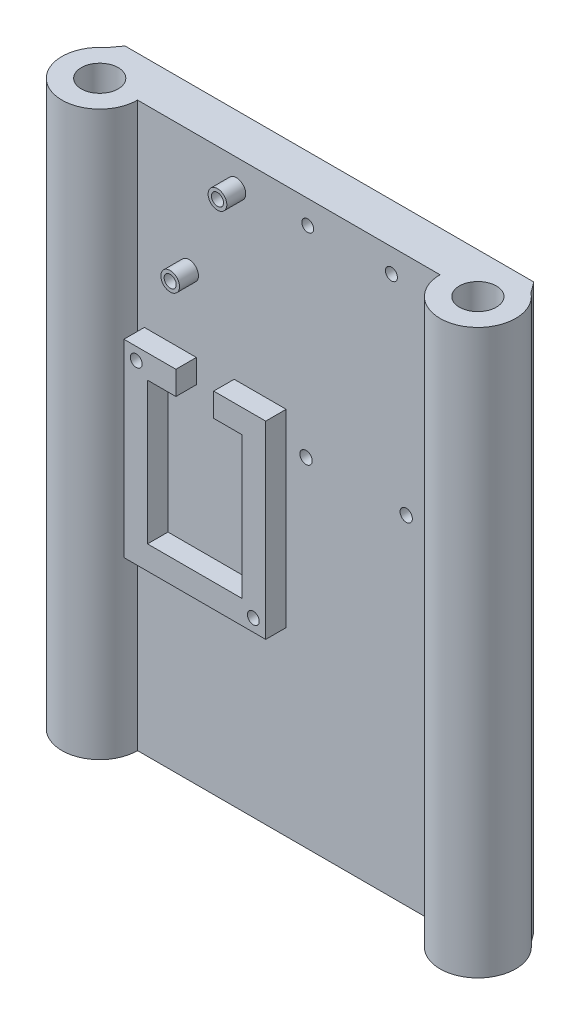
ISO-10303-21;
HEADER;
FILE_DESCRIPTION(('STEP AP214'),'2;1');
FILE_NAME('part.step','',(''),(''),'','','');
FILE_SCHEMA(('AUTOMOTIVE_DESIGN { 1 0 10303 214 1 1 1 1 }'));
ENDSEC;
DATA;
#1=APPLICATION_CONTEXT('core data for automotive mechanical design processes');
#2=APPLICATION_PROTOCOL_DEFINITION('international standard','automotive_design',2000,#1);
#3=PRODUCT_CONTEXT('',#1,'mechanical');
#4=PRODUCT('Part','Part','',(#3));
#5=PRODUCT_RELATED_PRODUCT_CATEGORY('part','',(#4));
#6=PRODUCT_DEFINITION_FORMATION('','',#4);
#7=PRODUCT_DEFINITION_CONTEXT('part definition',#1,'design');
#8=PRODUCT_DEFINITION('design','',#6,#7);
#9=PRODUCT_DEFINITION_SHAPE('','',#8);
#10=(LENGTH_UNIT() NAMED_UNIT(*) SI_UNIT(.MILLI.,.METRE.));
#11=(NAMED_UNIT(*) PLANE_ANGLE_UNIT() SI_UNIT($,.RADIAN.));
#12=(NAMED_UNIT(*) SI_UNIT($,.STERADIAN.) SOLID_ANGLE_UNIT());
#13=UNCERTAINTY_MEASURE_WITH_UNIT(LENGTH_MEASURE(1.E-05),#10,'distance_accuracy_value','');
#14=(GEOMETRIC_REPRESENTATION_CONTEXT(3) GLOBAL_UNCERTAINTY_ASSIGNED_CONTEXT((#13)) GLOBAL_UNIT_ASSIGNED_CONTEXT((#10,
#11,#12)) REPRESENTATION_CONTEXT('',''));
#15=CARTESIAN_POINT('',(0.,0.,0.));
#16=DIRECTION('',(0.,0.,1.));
#17=DIRECTION('',(1.,0.,0.));
#18=AXIS2_PLACEMENT_3D('',#15,#16,#17);
#19=CARTESIAN_POINT('',(0.,75.692,0.));
#20=DIRECTION('',(0.,0.,-1.));
#21=DIRECTION('',(-1.,0.,0.));
#22=AXIS2_PLACEMENT_3D('',#19,#20,#21);
#23=PLANE('',#22);
#24=DIRECTION('',(1.,0.,0.));
#25=VECTOR('',#24,1.);
#26=CARTESIAN_POINT('',(0.,17.3606924279355,0.));
#27=LINE('',#26,#25);
#28=CARTESIAN_POINT('',(-14.6777878533402,17.3606924279355,0.));
#29=VERTEX_POINT('',#28);
#30=CARTESIAN_POINT('',(-7.05778785334015,17.3606924279355,0.));
#31=VERTEX_POINT('',#30);
#32=EDGE_CURVE('E55',#29,#31,#27,.T.);
#33=ORIENTED_EDGE('',*,*,#32,.F.);
#34=DIRECTION('',(0.,1.,0.));
#35=VECTOR('',#34,1.);
#36=CARTESIAN_POINT('',(-14.6777878533402,0.,0.));
#37=LINE('',#36,#35);
#38=CARTESIAN_POINT('',(-14.6777878533402,23.7106924279355,0.));
#39=VERTEX_POINT('',#38);
#40=EDGE_CURVE('E170',#29,#39,#37,.T.);
#41=ORIENTED_EDGE('',*,*,#40,.T.);
#42=DIRECTION('',(-1.,0.,0.));
#43=VECTOR('',#42,1.);
#44=CARTESIAN_POINT('',(0.,23.7106924279355,0.));
#45=LINE('',#44,#43);
#46=CARTESIAN_POINT('',(-0.707787853340156,23.7106924279355,0.));
#47=VERTEX_POINT('',#46);
#48=EDGE_CURVE('E188',#47,#39,#45,.T.);
#49=ORIENTED_EDGE('',*,*,#48,.F.);
#50=DIRECTION('',(0.,1.,0.));
#51=VECTOR('',#50,1.);
#52=CARTESIAN_POINT('',(-0.707787853340151,0.,0.));
#53=LINE('',#52,#51);
#54=CARTESIAN_POINT('',(-0.707787853340146,-27.0893075720645,0.));
#55=VERTEX_POINT('',#54);
#56=EDGE_CURVE('E191',#55,#47,#53,.T.);
#57=ORIENTED_EDGE('',*,*,#56,.F.);
#58=DIRECTION('',(-1.,0.,0.));
#59=VECTOR('',#58,1.);
#60=CARTESIAN_POINT('',(0.,-27.0893075720645,0.));
#61=LINE('',#60,#59);
#62=CARTESIAN_POINT('',(-38.8077878533401,-27.0893075720645,0.));
#63=VERTEX_POINT('',#62);
#64=EDGE_CURVE('E232',#55,#63,#61,.T.);
#65=ORIENTED_EDGE('',*,*,#64,.T.);
#66=DIRECTION('',(0.,1.,0.));
#67=VECTOR('',#66,1.);
#68=CARTESIAN_POINT('',(-38.8077878533402,0.,0.));
#69=LINE('',#68,#67);
#70=CARTESIAN_POINT('',(-38.8077878533402,23.7106924279355,0.));
#71=VERTEX_POINT('',#70);
#72=EDGE_CURVE('E230',#63,#71,#69,.T.);
#73=ORIENTED_EDGE('',*,*,#72,.T.);
#74=CARTESIAN_POINT('',(-24.8377878533402,23.7106924279355,0.));
#75=VERTEX_POINT('',#74);
#76=EDGE_CURVE('E193',#75,#71,#45,.T.);
#77=ORIENTED_EDGE('',*,*,#76,.F.);
#78=DIRECTION('',(0.,1.,0.));
#79=VECTOR('',#78,1.);
#80=CARTESIAN_POINT('',(-24.8377878533402,0.,0.));
#81=LINE('',#80,#79);
#82=CARTESIAN_POINT('',(-24.8377878533402,17.3606924279355,0.));
#83=VERTEX_POINT('',#82);
#84=EDGE_CURVE('E226',#83,#75,#81,.T.);
#85=ORIENTED_EDGE('',*,*,#84,.F.);
#86=CARTESIAN_POINT('',(-32.4577878533402,17.3606924279355,0.));
#87=VERTEX_POINT('',#86);
#88=EDGE_CURVE('E219',#87,#83,#27,.T.);
#89=ORIENTED_EDGE('',*,*,#88,.F.);
#90=DIRECTION('',(0.,1.,0.));
#91=VECTOR('',#90,1.);
#92=CARTESIAN_POINT('',(-32.4577878533402,0.,0.));
#93=LINE('',#92,#91);
#94=CARTESIAN_POINT('',(-32.4577878533402,-20.7393075720645,0.));
#95=VERTEX_POINT('',#94);
#96=EDGE_CURVE('E223',#95,#87,#93,.T.);
#97=ORIENTED_EDGE('',*,*,#96,.F.);
#98=DIRECTION('',(1.,0.,0.));
#99=VECTOR('',#98,1.);
#100=CARTESIAN_POINT('',(0.,-20.7393075720645,0.));
#101=LINE('',#100,#99);
#102=CARTESIAN_POINT('',(-7.05778785334015,-20.7393075720645,0.));
#103=VERTEX_POINT('',#102);
#104=EDGE_CURVE('E221',#95,#103,#101,.T.);
#105=ORIENTED_EDGE('',*,*,#104,.T.);
#106=DIRECTION('',(0.,1.,0.));
#107=VECTOR('',#106,1.);
#108=CARTESIAN_POINT('',(-7.05778785334015,0.,0.));
#109=LINE('',#108,#107);
#110=EDGE_CURVE('E60',#103,#31,#109,.T.);
#111=ORIENTED_EDGE('',*,*,#110,.T.);
#112=EDGE_LOOP('',(#33,#41,#49,#57,#65,#73,#77,#85,#89,#97,#105,#111));
#113=FACE_BOUND('',#112,.T.);
#114=CARTESIAN_POINT('',(31.5542533198137,15.1951129980681,0.));
#115=DIRECTION('',(0.,0.,1.));
#116=DIRECTION('',(1.,0.,0.));
#117=AXIS2_PLACEMENT_3D('',#114,#115,#116);
#118=CIRCLE('',#117,1.65100000000003);
#119=CARTESIAN_POINT('',(33.2052533198137,15.1951129980681,0.));
#120=VERTEX_POINT('',#119);
#121=EDGE_CURVE('E279',#120,#120,#118,.T.);
#122=ORIENTED_EDGE('',*,*,#121,.F.);
#123=EDGE_LOOP('',(#122));
#124=FACE_BOUND('',#123,.T.);
#125=CARTESIAN_POINT('',(4.63025825837027,15.1788055956563,0.));
#126=DIRECTION('',(0.,0.,1.));
#127=DIRECTION('',(1.,0.,0.));
#128=AXIS2_PLACEMENT_3D('',#125,#126,#127);
#129=CIRCLE('',#128,1.65100000000001);
#130=CARTESIAN_POINT('',(6.28125825837028,15.1788055956563,0.));
#131=VERTEX_POINT('',#130);
#132=EDGE_CURVE('E273',#131,#131,#129,.T.);
#133=ORIENTED_EDGE('',*,*,#132,.F.);
#134=EDGE_LOOP('',(#133));
#135=FACE_BOUND('',#134,.T.);
#136=CARTESIAN_POINT('',(27.5694661719166,69.3267080357224,0.));
#137=DIRECTION('',(0.,0.,1.));
#138=DIRECTION('',(1.,0.,0.));
#139=AXIS2_PLACEMENT_3D('',#136,#137,#138);
#140=CIRCLE('',#139,1.61596885112658);
#141=CARTESIAN_POINT('',(29.1854350230432,69.3267080357224,0.));
#142=VERTEX_POINT('',#141);
#143=EDGE_CURVE('E266',#142,#142,#140,.T.);
#144=ORIENTED_EDGE('',*,*,#143,.F.);
#145=EDGE_LOOP('',(#144));
#146=FACE_BOUND('',#145,.T.);
#147=CARTESIAN_POINT('',(5.09714245794746,69.3380368558654,0.));
#148=DIRECTION('',(0.,0.,1.));
#149=DIRECTION('',(1.,0.,0.));
#150=AXIS2_PLACEMENT_3D('',#147,#148,#149);
#151=CIRCLE('',#150,1.58055969887094);
#152=CARTESIAN_POINT('',(6.6777021568184,69.3380368558654,0.));
#153=VERTEX_POINT('',#152);
#154=EDGE_CURVE('E269',#153,#153,#151,.T.);
#155=ORIENTED_EDGE('',*,*,#154,.F.);
#156=EDGE_LOOP('',(#155));
#157=FACE_BOUND('',#156,.T.);
#158=CARTESIAN_POINT('',(-26.7870758196598,43.0050416050207,0.));
#159=DIRECTION('',(0.,0.,-1.));
#160=DIRECTION('',(-1.,0.,0.));
#161=AXIS2_PLACEMENT_3D('',#158,#159,#160);
#162=CIRCLE('',#161,2.51141514633303);
#163=CARTESIAN_POINT('',(-29.2984909659929,43.0050416050207,0.));
#164=VERTEX_POINT('',#163);
#165=EDGE_CURVE('E48',#164,#164,#162,.F.);
#166=ORIENTED_EDGE('',*,*,#165,.F.);
#167=EDGE_LOOP('',(#166));
#168=FACE_BOUND('',#167,.T.);
#169=DIRECTION('',(1.,0.,0.));
#170=VECTOR('',#169,1.);
#171=CARTESIAN_POINT('',(0.,-75.692,0.));
#172=LINE('',#171,#170);
#173=CARTESIAN_POINT('',(-40.64,-75.692,0.));
#174=VERTEX_POINT('',#173);
#175=CARTESIAN_POINT('',(40.64,-75.692,0.));
#176=VERTEX_POINT('',#175);
#177=EDGE_CURVE('E331',#174,#176,#172,.T.);
#178=ORIENTED_EDGE('',*,*,#177,.T.);
#179=DIRECTION('',(0.,-1.,0.));
#180=VECTOR('',#179,1.);
#181=CARTESIAN_POINT('',(40.64,75.692,0.));
#182=LINE('',#181,#180);
#183=CARTESIAN_POINT('',(40.64,75.692,0.));
#184=VERTEX_POINT('',#183);
#185=EDGE_CURVE('E356',#184,#176,#182,.T.);
#186=ORIENTED_EDGE('',*,*,#185,.F.);
#187=DIRECTION('',(1.,0.,0.));
#188=VECTOR('',#187,1.);
#189=CARTESIAN_POINT('',(0.,75.692,0.));
#190=LINE('',#189,#188);
#191=CARTESIAN_POINT('',(-40.64,75.692,0.));
#192=VERTEX_POINT('',#191);
#193=EDGE_CURVE('E311',#192,#184,#190,.T.);
#194=ORIENTED_EDGE('',*,*,#193,.F.);
#195=DIRECTION('',(0.,-1.,0.));
#196=VECTOR('',#195,1.);
#197=CARTESIAN_POINT('',(-40.64,75.692,0.));
#198=LINE('',#197,#196);
#199=EDGE_CURVE('E359',#192,#174,#198,.T.);
#200=ORIENTED_EDGE('',*,*,#199,.T.);
#201=EDGE_LOOP('',(#178,#186,#194,#200));
#202=FACE_BOUND('',#201,.T.);
#203=CARTESIAN_POINT('',(-14.0870758196598,68.4050416050207,0.));
#204=DIRECTION('',(0.,0.,-1.));
#205=DIRECTION('',(-1.,0.,0.));
#206=AXIS2_PLACEMENT_3D('',#203,#204,#205);
#207=CIRCLE('',#206,2.51141514633303);
#208=CARTESIAN_POINT('',(-16.5984909659929,68.4050416050207,0.));
#209=VERTEX_POINT('',#208);
#210=EDGE_CURVE('E11',#209,#209,#207,.F.);
#211=ORIENTED_EDGE('',*,*,#210,.F.);
#212=EDGE_LOOP('',(#211));
#213=FACE_BOUND('',#212,.T.);
#214=ADVANCED_FACE('F40',(#113,#124,#135,#146,#157,#168,#202,#213),#23,.F.);
#215=CARTESIAN_POINT('',(-50.8,75.692,0.));
#216=DIRECTION('',(0.,-1.,0.));
#217=DIRECTION('',(0.,0.,-1.));
#218=AXIS2_PLACEMENT_3D('',#215,#216,#217);
#219=CYLINDRICAL_SURFACE('',#218,10.16);
#220=CARTESIAN_POINT('',(-50.8,-75.692,0.));
#221=DIRECTION('',(0.,1.,0.));
#222=DIRECTION('',(0.,0.,1.));
#223=AXIS2_PLACEMENT_3D('',#220,#221,#222);
#224=CIRCLE('',#223,10.16);
#225=CARTESIAN_POINT('',(-57.0241254616946,-75.692,-8.03030897519421));
#226=VERTEX_POINT('',#225);
#227=EDGE_CURVE('E305',#226,#174,#224,.T.);
#228=ORIENTED_EDGE('',*,*,#227,.T.);
#229=ORIENTED_EDGE('',*,*,#199,.F.);
#230=CARTESIAN_POINT('',(-50.8,75.692,0.));
#231=DIRECTION('',(0.,1.,0.));
#232=DIRECTION('',(0.,0.,1.));
#233=AXIS2_PLACEMENT_3D('',#230,#231,#232);
#234=CIRCLE('',#233,10.16);
#235=CARTESIAN_POINT('',(-57.0241254616946,75.692,-8.03030897519421));
#236=VERTEX_POINT('',#235);
#237=EDGE_CURVE('E308',#236,#192,#234,.T.);
#238=ORIENTED_EDGE('',*,*,#237,.F.);
#239=DIRECTION('',(0.,-1.,0.));
#240=VECTOR('',#239,1.);
#241=CARTESIAN_POINT('',(-57.0241254616946,75.692,-8.03030897519421));
#242=LINE('',#241,#240);
#243=EDGE_CURVE('E328',#236,#226,#242,.T.);
#244=ORIENTED_EDGE('',*,*,#243,.T.);
#245=EDGE_LOOP('',(#228,#229,#238,#244));
#246=FACE_BOUND('',#245,.T.);
#247=ADVANCED_FACE('F42',(#246),#219,.T.);
#248=CARTESIAN_POINT('',(50.8,75.692,0.));
#249=DIRECTION('',(0.,-1.,0.));
#250=DIRECTION('',(0.,0.,-1.));
#251=AXIS2_PLACEMENT_3D('',#248,#249,#250);
#252=CYLINDRICAL_SURFACE('',#251,10.16);
#253=CARTESIAN_POINT('',(50.8,-75.692,0.));
#254=DIRECTION('',(0.,1.,0.));
#255=DIRECTION('',(0.,0.,1.));
#256=AXIS2_PLACEMENT_3D('',#253,#254,#255);
#257=CIRCLE('',#256,10.16);
#258=CARTESIAN_POINT('',(57.0241254616946,-75.692,-8.03030897519423));
#259=VERTEX_POINT('',#258);
#260=EDGE_CURVE('E333',#176,#259,#257,.T.);
#261=ORIENTED_EDGE('',*,*,#260,.T.);
#262=DIRECTION('',(0.,-1.,0.));
#263=VECTOR('',#262,1.);
#264=CARTESIAN_POINT('',(57.0241254616946,75.692,-8.03030897519423));
#265=LINE('',#264,#263);
#266=CARTESIAN_POINT('',(57.0241254616946,75.692,-8.03030897519423));
#267=VERTEX_POINT('',#266);
#268=EDGE_CURVE('E353',#267,#259,#265,.T.);
#269=ORIENTED_EDGE('',*,*,#268,.F.);
#270=CARTESIAN_POINT('',(50.8,75.692,0.));
#271=DIRECTION('',(0.,1.,0.));
#272=DIRECTION('',(0.,0.,1.));
#273=AXIS2_PLACEMENT_3D('',#270,#271,#272);
#274=CIRCLE('',#273,10.16);
#275=EDGE_CURVE('E314',#184,#267,#274,.T.);
#276=ORIENTED_EDGE('',*,*,#275,.F.);
#277=ORIENTED_EDGE('',*,*,#185,.T.);
#278=EDGE_LOOP('',(#261,#269,#276,#277));
#279=FACE_BOUND('',#278,.T.);
#280=ADVANCED_FACE('F426',(#279),#252,.T.);
#281=CARTESIAN_POINT('',(0.,75.692,31.7761175748986));
#282=DIRECTION('',(0.,-1.,0.));
#283=DIRECTION('',(0.,0.,-1.));
#284=AXIS2_PLACEMENT_3D('',#281,#282,#283);
#285=CYLINDRICAL_SURFACE('',#284,69.5435293852636);
#286=CARTESIAN_POINT('',(0.,-75.692,31.7761175748986));
#287=DIRECTION('',(0.,1.,0.));
#288=DIRECTION('',(0.,0.,1.));
#289=AXIS2_PLACEMENT_3D('',#286,#287,#288);
#290=CIRCLE('',#289,69.5435293852636);
#291=CARTESIAN_POINT('',(54.8982329464568,-75.692,-10.9144727081555));
#292=VERTEX_POINT('',#291);
#293=EDGE_CURVE('E335',#259,#292,#290,.T.);
#294=ORIENTED_EDGE('',*,*,#293,.T.);
#295=DIRECTION('',(0.,-1.,0.));
#296=VECTOR('',#295,1.);
#297=CARTESIAN_POINT('',(54.8982329464568,75.692,-10.9144727081555));
#298=LINE('',#297,#296);
#299=CARTESIAN_POINT('',(54.8982329464568,75.692,-10.9144727081555));
#300=VERTEX_POINT('',#299);
#301=EDGE_CURVE('E351',#300,#292,#298,.T.);
#302=ORIENTED_EDGE('',*,*,#301,.F.);
#303=CARTESIAN_POINT('',(0.,75.692,31.7761175748986));
#304=DIRECTION('',(0.,1.,0.));
#305=DIRECTION('',(0.,0.,1.));
#306=AXIS2_PLACEMENT_3D('',#303,#304,#305);
#307=CIRCLE('',#306,69.5435293852636);
#308=EDGE_CURVE('E316',#267,#300,#307,.T.);
#309=ORIENTED_EDGE('',*,*,#308,.F.);
#310=ORIENTED_EDGE('',*,*,#268,.T.);
#311=EDGE_LOOP('',(#294,#302,#309,#310));
#312=FACE_BOUND('',#311,.T.);
#313=ADVANCED_FACE('F422',(#312),#285,.T.);
#314=CARTESIAN_POINT('',(0.,75.692,-10.9144727081554));
#315=DIRECTION('',(0.,0.,-1.));
#316=DIRECTION('',(-1.,0.,0.));
#317=AXIS2_PLACEMENT_3D('',#314,#315,#316);
#318=PLANE('',#317);
#319=CARTESIAN_POINT('',(-35.4829098483778,20.3858144229731,-10.9144727081555));
#320=DIRECTION('',(0.,0.,1.));
#321=DIRECTION('',(1.,0.,0.));
#322=AXIS2_PLACEMENT_3D('',#319,#320,#321);
#323=CIRCLE('',#322,1.5875);
#324=CARTESIAN_POINT('',(-33.8954098483778,20.3858144229731,-10.9144727081555));
#325=VERTEX_POINT('',#324);
#326=EDGE_CURVE('E217',#325,#325,#323,.T.);
#327=ORIENTED_EDGE('',*,*,#326,.T.);
#328=EDGE_LOOP('',(#327));
#329=FACE_BOUND('',#328,.T.);
#330=CARTESIAN_POINT('',(-4.03266585830249,-23.7644295671022,-10.9144727081555));
#331=DIRECTION('',(0.,0.,1.));
#332=DIRECTION('',(1.,0.,0.));
#333=AXIS2_PLACEMENT_3D('',#330,#331,#332);
#334=CIRCLE('',#333,1.5875);
#335=CARTESIAN_POINT('',(-2.44516585830248,-23.7644295671022,-10.9144727081555));
#336=VERTEX_POINT('',#335);
#337=EDGE_CURVE('E195',#336,#336,#334,.T.);
#338=ORIENTED_EDGE('',*,*,#337,.T.);
#339=EDGE_LOOP('',(#338));
#340=FACE_BOUND('',#339,.T.);
#341=CARTESIAN_POINT('',(31.5542533198137,15.1951129980681,-10.9144727081555));
#342=DIRECTION('',(0.,0.,1.));
#343=DIRECTION('',(1.,0.,0.));
#344=AXIS2_PLACEMENT_3D('',#341,#342,#343);
#345=CIRCLE('',#344,1.65100000000003);
#346=CARTESIAN_POINT('',(33.2052533198137,15.1951129980681,-10.9144727081555));
#347=VERTEX_POINT('',#346);
#348=EDGE_CURVE('E172',#347,#347,#345,.T.);
#349=ORIENTED_EDGE('',*,*,#348,.T.);
#350=EDGE_LOOP('',(#349));
#351=FACE_BOUND('',#350,.T.);
#352=CARTESIAN_POINT('',(4.63025825837027,15.1788055956563,-10.9144727081555));
#353=DIRECTION('',(0.,0.,1.));
#354=DIRECTION('',(1.,0.,0.));
#355=AXIS2_PLACEMENT_3D('',#352,#353,#354);
#356=CIRCLE('',#355,1.65100000000001);
#357=CARTESIAN_POINT('',(6.28125825837028,15.1788055956563,-10.9144727081555));
#358=VERTEX_POINT('',#357);
#359=EDGE_CURVE('E276',#358,#358,#356,.T.);
#360=ORIENTED_EDGE('',*,*,#359,.T.);
#361=EDGE_LOOP('',(#360));
#362=FACE_BOUND('',#361,.T.);
#363=CARTESIAN_POINT('',(27.5694661719166,69.3267080357224,-10.9144727081555));
#364=DIRECTION('',(0.,0.,1.));
#365=DIRECTION('',(1.,0.,0.));
#366=AXIS2_PLACEMENT_3D('',#363,#364,#365);
#367=CIRCLE('',#366,1.61596885112658);
#368=CARTESIAN_POINT('',(29.1854350230432,69.3267080357224,-10.9144727081555));
#369=VERTEX_POINT('',#368);
#370=EDGE_CURVE('E270',#369,#369,#367,.T.);
#371=ORIENTED_EDGE('',*,*,#370,.T.);
#372=EDGE_LOOP('',(#371));
#373=FACE_BOUND('',#372,.T.);
#374=CARTESIAN_POINT('',(5.09714245794746,69.3380368558654,-10.9144727081555));
#375=DIRECTION('',(0.,0.,1.));
#376=DIRECTION('',(1.,0.,0.));
#377=AXIS2_PLACEMENT_3D('',#374,#375,#376);
#378=CIRCLE('',#377,1.58055969887094);
#379=CARTESIAN_POINT('',(6.6777021568184,69.3380368558654,-10.9144727081555));
#380=VERTEX_POINT('',#379);
#381=EDGE_CURVE('E284',#380,#380,#378,.T.);
#382=ORIENTED_EDGE('',*,*,#381,.T.);
#383=EDGE_LOOP('',(#382));
#384=FACE_BOUND('',#383,.T.);
#385=CARTESIAN_POINT('',(-14.0870758196598,68.4050416050207,-10.9144727081555));
#386=DIRECTION('',(0.,0.,1.));
#387=DIRECTION('',(1.,0.,0.));
#388=AXIS2_PLACEMENT_3D('',#385,#386,#387);
#389=CIRCLE('',#388,1.6256);
#390=CARTESIAN_POINT('',(-12.4614758196598,68.4050416050207,-10.9144727081555));
#391=VERTEX_POINT('',#390);
#392=EDGE_CURVE('E302',#391,#391,#389,.T.);
#393=ORIENTED_EDGE('',*,*,#392,.T.);
#394=EDGE_LOOP('',(#393));
#395=FACE_BOUND('',#394,.T.);
#396=CARTESIAN_POINT('',(-26.7870758196598,43.0050416050207,-10.9144727081555));
#397=DIRECTION('',(0.,0.,1.));
#398=DIRECTION('',(1.,0.,0.));
#399=AXIS2_PLACEMENT_3D('',#396,#397,#398);
#400=CIRCLE('',#399,1.6256);
#401=CARTESIAN_POINT('',(-25.1614758196598,43.0050416050207,-10.9144727081555));
#402=VERTEX_POINT('',#401);
#403=EDGE_CURVE('E297',#402,#402,#400,.T.);
#404=ORIENTED_EDGE('',*,*,#403,.T.);
#405=EDGE_LOOP('',(#404));
#406=FACE_BOUND('',#405,.T.);
#407=DIRECTION('',(1.,0.,0.));
#408=VECTOR('',#407,1.);
#409=CARTESIAN_POINT('',(0.,-75.692,-10.9144727081554));
#410=LINE('',#409,#408);
#411=CARTESIAN_POINT('',(-54.8982329464568,-75.692,-10.9144727081554));
#412=VERTEX_POINT('',#411);
#413=EDGE_CURVE('E338',#412,#292,#410,.T.);
#414=ORIENTED_EDGE('',*,*,#413,.F.);
#415=DIRECTION('',(0.,-1.,0.));
#416=VECTOR('',#415,1.);
#417=CARTESIAN_POINT('',(-54.8982329464568,75.692,-10.9144727081554));
#418=LINE('',#417,#416);
#419=CARTESIAN_POINT('',(-54.8982329464568,75.692,-10.9144727081554));
#420=VERTEX_POINT('',#419);
#421=EDGE_CURVE('E349',#420,#412,#418,.T.);
#422=ORIENTED_EDGE('',*,*,#421,.F.);
#423=DIRECTION('',(1.,0.,0.));
#424=VECTOR('',#423,1.);
#425=CARTESIAN_POINT('',(0.,75.692,-10.9144727081554));
#426=LINE('',#425,#424);
#427=EDGE_CURVE('E318',#420,#300,#426,.T.);
#428=ORIENTED_EDGE('',*,*,#427,.T.);
#429=ORIENTED_EDGE('',*,*,#301,.T.);
#430=EDGE_LOOP('',(#414,#422,#428,#429));
#431=FACE_BOUND('',#430,.T.);
#432=ADVANCED_FACE('F417',(#329,#340,#351,#362,#373,#384,#395,#406,#431),#318,.T.);
#433=CARTESIAN_POINT('',(-50.8,75.692,0.));
#434=DIRECTION('',(0.,-1.,0.));
#435=DIRECTION('',(0.,0.,-1.));
#436=AXIS2_PLACEMENT_3D('',#433,#434,#435);
#437=CYLINDRICAL_SURFACE('',#436,4.9609375);
#438=CARTESIAN_POINT('',(-50.8,75.692,0.));
#439=DIRECTION('',(0.,1.,0.));
#440=DIRECTION('',(0.,0.,1.));
#441=AXIS2_PLACEMENT_3D('',#438,#439,#440);
#442=CIRCLE('',#441,4.9609375);
#443=CARTESIAN_POINT('',(-50.8,75.692,4.9609375));
#444=VERTEX_POINT('',#443);
#445=EDGE_CURVE('E322',#444,#444,#442,.T.);
#446=ORIENTED_EDGE('',*,*,#445,.T.);
#447=EDGE_LOOP('',(#446));
#448=FACE_BOUND('',#447,.T.);
#449=CARTESIAN_POINT('',(-50.8,-75.692,0.));
#450=DIRECTION('',(0.,1.,0.));
#451=DIRECTION('',(0.,0.,1.));
#452=AXIS2_PLACEMENT_3D('',#449,#450,#451);
#453=CIRCLE('',#452,4.9609375);
#454=CARTESIAN_POINT('',(-50.8,-75.692,4.9609375));
#455=VERTEX_POINT('',#454);
#456=EDGE_CURVE('E342',#455,#455,#453,.T.);
#457=ORIENTED_EDGE('',*,*,#456,.F.);
#458=EDGE_LOOP('',(#457));
#459=FACE_BOUND('',#458,.T.);
#460=ADVANCED_FACE('F414',(#448,#459),#437,.F.);
#461=EDGE_CURVE('E339',#412,#226,#290,.T.);
#462=ORIENTED_EDGE('',*,*,#461,.T.);
#463=ORIENTED_EDGE('',*,*,#243,.F.);
#464=EDGE_CURVE('E319',#420,#236,#307,.T.);
#465=ORIENTED_EDGE('',*,*,#464,.F.);
#466=ORIENTED_EDGE('',*,*,#421,.T.);
#467=EDGE_LOOP('',(#462,#463,#465,#466));
#468=FACE_BOUND('',#467,.T.);
#469=ADVANCED_FACE('F412',(#468),#285,.T.);
#470=CARTESIAN_POINT('',(50.8,75.692,0.));
#471=DIRECTION('',(0.,-1.,0.));
#472=DIRECTION('',(0.,0.,-1.));
#473=AXIS2_PLACEMENT_3D('',#470,#471,#472);
#474=CYLINDRICAL_SURFACE('',#473,4.9609375);
#475=CARTESIAN_POINT('',(50.8,75.692,0.));
#476=DIRECTION('',(0.,1.,0.));
#477=DIRECTION('',(0.,0.,1.));
#478=AXIS2_PLACEMENT_3D('',#475,#476,#477);
#479=CIRCLE('',#478,4.9609375);
#480=CARTESIAN_POINT('',(50.8,75.692,4.96093749999998));
#481=VERTEX_POINT('',#480);
#482=EDGE_CURVE('E325',#481,#481,#479,.T.);
#483=ORIENTED_EDGE('',*,*,#482,.T.);
#484=EDGE_LOOP('',(#483));
#485=FACE_BOUND('',#484,.T.);
#486=CARTESIAN_POINT('',(50.8,-75.692,0.));
#487=DIRECTION('',(0.,1.,0.));
#488=DIRECTION('',(0.,0.,1.));
#489=AXIS2_PLACEMENT_3D('',#486,#487,#488);
#490=CIRCLE('',#489,4.9609375);
#491=CARTESIAN_POINT('',(50.8,-75.692,4.96093749999998));
#492=VERTEX_POINT('',#491);
#493=EDGE_CURVE('E312',#492,#492,#490,.T.);
#494=ORIENTED_EDGE('',*,*,#493,.F.);
#495=EDGE_LOOP('',(#494));
#496=FACE_BOUND('',#495,.T.);
#497=ADVANCED_FACE('F405',(#485,#496),#474,.F.);
#498=CARTESIAN_POINT('',(0.,75.692,0.));
#499=DIRECTION('',(0.,1.,0.));
#500=DIRECTION('',(0.,0.,1.));
#501=AXIS2_PLACEMENT_3D('',#498,#499,#500);
#502=PLANE('',#501);
#503=ORIENTED_EDGE('',*,*,#237,.T.);
#504=ORIENTED_EDGE('',*,*,#193,.T.);
#505=ORIENTED_EDGE('',*,*,#275,.T.);
#506=ORIENTED_EDGE('',*,*,#308,.T.);
#507=ORIENTED_EDGE('',*,*,#427,.F.);
#508=ORIENTED_EDGE('',*,*,#464,.T.);
#509=EDGE_LOOP('',(#503,#504,#505,#506,#507,#508));
#510=FACE_BOUND('',#509,.T.);
#511=ORIENTED_EDGE('',*,*,#445,.F.);
#512=EDGE_LOOP('',(#511));
#513=FACE_BOUND('',#512,.T.);
#514=ORIENTED_EDGE('',*,*,#482,.F.);
#515=EDGE_LOOP('',(#514));
#516=FACE_BOUND('',#515,.T.);
#517=ADVANCED_FACE('F402',(#510,#513,#516),#502,.T.);
#518=CARTESIAN_POINT('',(0.,-75.692,0.));
#519=DIRECTION('',(0.,1.,0.));
#520=DIRECTION('',(0.,0.,1.));
#521=AXIS2_PLACEMENT_3D('',#518,#519,#520);
#522=PLANE('',#521);
#523=ORIENTED_EDGE('',*,*,#227,.F.);
#524=ORIENTED_EDGE('',*,*,#461,.F.);
#525=ORIENTED_EDGE('',*,*,#413,.T.);
#526=ORIENTED_EDGE('',*,*,#293,.F.);
#527=ORIENTED_EDGE('',*,*,#260,.F.);
#528=ORIENTED_EDGE('',*,*,#177,.F.);
#529=EDGE_LOOP('',(#523,#524,#525,#526,#527,#528));
#530=FACE_BOUND('',#529,.T.);
#531=ORIENTED_EDGE('',*,*,#456,.T.);
#532=EDGE_LOOP('',(#531));
#533=FACE_BOUND('',#532,.T.);
#534=ORIENTED_EDGE('',*,*,#493,.T.);
#535=EDGE_LOOP('',(#534));
#536=FACE_BOUND('',#535,.T.);
#537=ADVANCED_FACE('F400',(#530,#533,#536),#522,.F.);
#538=CARTESIAN_POINT('',(-26.7870758196598,43.0050416050207,-10.9144727081555));
#539=DIRECTION('',(0.,0.,1.));
#540=DIRECTION('',(1.,0.,0.));
#541=AXIS2_PLACEMENT_3D('',#538,#539,#540);
#542=CYLINDRICAL_SURFACE('',#541,1.6256);
#543=ORIENTED_EDGE('',*,*,#403,.F.);
#544=EDGE_LOOP('',(#543));
#545=FACE_BOUND('',#544,.T.);
#546=CARTESIAN_POINT('',(-26.7870758196598,43.0050416050207,5.08));
#547=DIRECTION('',(0.,0.,1.));
#548=DIRECTION('',(1.,0.,0.));
#549=AXIS2_PLACEMENT_3D('',#546,#547,#548);
#550=CIRCLE('',#549,1.6256);
#551=CARTESIAN_POINT('',(-25.1614758196598,43.0050416050207,5.08));
#552=VERTEX_POINT('',#551);
#553=EDGE_CURVE('E287',#552,#552,#550,.T.);
#554=ORIENTED_EDGE('',*,*,#553,.T.);
#555=EDGE_LOOP('',(#554));
#556=FACE_BOUND('',#555,.T.);
#557=ADVANCED_FACE('F396',(#545,#556),#542,.F.);
#558=CARTESIAN_POINT('',(-14.0870758196598,68.4050416050207,-10.9144727081555));
#559=DIRECTION('',(0.,0.,1.));
#560=DIRECTION('',(1.,0.,0.));
#561=AXIS2_PLACEMENT_3D('',#558,#559,#560);
#562=CYLINDRICAL_SURFACE('',#561,1.6256);
#563=ORIENTED_EDGE('',*,*,#392,.F.);
#564=EDGE_LOOP('',(#563));
#565=FACE_BOUND('',#564,.T.);
#566=CARTESIAN_POINT('',(-14.0870758196598,68.4050416050207,5.08));
#567=DIRECTION('',(0.,0.,1.));
#568=DIRECTION('',(1.,0.,0.));
#569=AXIS2_PLACEMENT_3D('',#566,#567,#568);
#570=CIRCLE('',#569,1.6256);
#571=CARTESIAN_POINT('',(-12.4614758196598,68.4050416050207,5.08));
#572=VERTEX_POINT('',#571);
#573=EDGE_CURVE('E290',#572,#572,#570,.T.);
#574=ORIENTED_EDGE('',*,*,#573,.T.);
#575=EDGE_LOOP('',(#574));
#576=FACE_BOUND('',#575,.T.);
#577=ADVANCED_FACE('F384',(#565,#576),#562,.F.);
#578=CARTESIAN_POINT('',(-14.0870758196598,68.4050416050207,5.08));
#579=DIRECTION('',(0.,0.,1.));
#580=DIRECTION('',(1.,0.,0.));
#581=AXIS2_PLACEMENT_3D('',#578,#579,#580);
#582=PLANE('',#581);
#583=CARTESIAN_POINT('',(-14.0870758196598,68.4050416050207,5.08));
#584=DIRECTION('',(0.,0.,1.));
#585=DIRECTION('',(1.,0.,0.));
#586=AXIS2_PLACEMENT_3D('',#583,#584,#585);
#587=CIRCLE('',#586,2.51141514633303);
#588=CARTESIAN_POINT('',(-11.5756606733268,68.4050416050207,5.08));
#589=VERTEX_POINT('',#588);
#590=EDGE_CURVE('E293',#589,#589,#587,.T.);
#591=ORIENTED_EDGE('',*,*,#590,.T.);
#592=EDGE_LOOP('',(#591));
#593=FACE_BOUND('',#592,.T.);
#594=ORIENTED_EDGE('',*,*,#573,.F.);
#595=EDGE_LOOP('',(#594));
#596=FACE_BOUND('',#595,.T.);
#597=ADVANCED_FACE('F375',(#593,#596),#582,.T.);
#598=CARTESIAN_POINT('',(-14.0870758196598,68.4050416050207,5.08));
#599=DIRECTION('',(0.,0.,-1.));
#600=DIRECTION('',(-1.,0.,0.));
#601=AXIS2_PLACEMENT_3D('',#598,#599,#600);
#602=CYLINDRICAL_SURFACE('',#601,2.51141514633303);
#603=ORIENTED_EDGE('',*,*,#590,.F.);
#604=EDGE_LOOP('',(#603));
#605=FACE_BOUND('',#604,.T.);
#606=ORIENTED_EDGE('',*,*,#210,.T.);
#607=EDGE_LOOP('',(#606));
#608=FACE_BOUND('',#607,.T.);
#609=ADVANCED_FACE('F372',(#605,#608),#602,.T.);
#610=CARTESIAN_POINT('',(-26.7870758196598,43.0050416050207,5.08));
#611=DIRECTION('',(0.,0.,1.));
#612=DIRECTION('',(1.,0.,0.));
#613=AXIS2_PLACEMENT_3D('',#610,#611,#612);
#614=PLANE('',#613);
#615=CARTESIAN_POINT('',(-26.7870758196598,43.0050416050207,5.08));
#616=DIRECTION('',(0.,0.,1.));
#617=DIRECTION('',(1.,0.,0.));
#618=AXIS2_PLACEMENT_3D('',#615,#616,#617);
#619=CIRCLE('',#618,2.51141514633303);
#620=CARTESIAN_POINT('',(-24.2756606733268,43.0050416050207,5.08));
#621=VERTEX_POINT('',#620);
#622=EDGE_CURVE('E294',#621,#621,#619,.T.);
#623=ORIENTED_EDGE('',*,*,#622,.T.);
#624=EDGE_LOOP('',(#623));
#625=FACE_BOUND('',#624,.T.);
#626=ORIENTED_EDGE('',*,*,#553,.F.);
#627=EDGE_LOOP('',(#626));
#628=FACE_BOUND('',#627,.T.);
#629=ADVANCED_FACE('F374',(#625,#628),#614,.T.);
#630=CARTESIAN_POINT('',(-26.7870758196598,43.0050416050207,5.08));
#631=DIRECTION('',(0.,0.,-1.));
#632=DIRECTION('',(-1.,0.,0.));
#633=AXIS2_PLACEMENT_3D('',#630,#631,#632);
#634=CYLINDRICAL_SURFACE('',#633,2.51141514633303);
#635=ORIENTED_EDGE('',*,*,#622,.F.);
#636=EDGE_LOOP('',(#635));
#637=FACE_BOUND('',#636,.T.);
#638=ORIENTED_EDGE('',*,*,#165,.T.);
#639=EDGE_LOOP('',(#638));
#640=FACE_BOUND('',#639,.T.);
#641=ADVANCED_FACE('F364',(#637,#640),#634,.T.);
#642=CARTESIAN_POINT('',(5.09714245794746,69.3380368558654,-10.9144727081555));
#643=DIRECTION('',(0.,0.,1.));
#644=DIRECTION('',(1.,0.,0.));
#645=AXIS2_PLACEMENT_3D('',#642,#643,#644);
#646=CYLINDRICAL_SURFACE('',#645,1.58055969887094);
#647=ORIENTED_EDGE('',*,*,#381,.F.);
#648=EDGE_LOOP('',(#647));
#649=FACE_BOUND('',#648,.T.);
#650=ORIENTED_EDGE('',*,*,#154,.T.);
#651=EDGE_LOOP('',(#650));
#652=FACE_BOUND('',#651,.T.);
#653=ADVANCED_FACE('F392',(#649,#652),#646,.F.);
#654=CARTESIAN_POINT('',(27.5694661719166,69.3267080357224,-10.9144727081555));
#655=DIRECTION('',(0.,0.,1.));
#656=DIRECTION('',(1.,0.,0.));
#657=AXIS2_PLACEMENT_3D('',#654,#655,#656);
#658=CYLINDRICAL_SURFACE('',#657,1.61596885112658);
#659=ORIENTED_EDGE('',*,*,#370,.F.);
#660=EDGE_LOOP('',(#659));
#661=FACE_BOUND('',#660,.T.);
#662=ORIENTED_EDGE('',*,*,#143,.T.);
#663=EDGE_LOOP('',(#662));
#664=FACE_BOUND('',#663,.T.);
#665=ADVANCED_FACE('F691',(#661,#664),#658,.F.);
#666=CARTESIAN_POINT('',(4.63025825837027,15.1788055956563,-10.9144727081555));
#667=DIRECTION('',(0.,0.,1.));
#668=DIRECTION('',(1.,0.,0.));
#669=AXIS2_PLACEMENT_3D('',#666,#667,#668);
#670=CYLINDRICAL_SURFACE('',#669,1.65100000000001);
#671=ORIENTED_EDGE('',*,*,#359,.F.);
#672=EDGE_LOOP('',(#671));
#673=FACE_BOUND('',#672,.T.);
#674=ORIENTED_EDGE('',*,*,#132,.T.);
#675=EDGE_LOOP('',(#674));
#676=FACE_BOUND('',#675,.T.);
#677=ADVANCED_FACE('F694',(#673,#676),#670,.F.);
#678=CARTESIAN_POINT('',(31.5542533198137,15.1951129980681,-10.9144727081555));
#679=DIRECTION('',(0.,0.,1.));
#680=DIRECTION('',(1.,0.,0.));
#681=AXIS2_PLACEMENT_3D('',#678,#679,#680);
#682=CYLINDRICAL_SURFACE('',#681,1.65100000000003);
#683=ORIENTED_EDGE('',*,*,#348,.F.);
#684=EDGE_LOOP('',(#683));
#685=FACE_BOUND('',#684,.T.);
#686=ORIENTED_EDGE('',*,*,#121,.T.);
#687=EDGE_LOOP('',(#686));
#688=FACE_BOUND('',#687,.T.);
#689=ADVANCED_FACE('F555',(#685,#688),#682,.F.);
#690=CARTESIAN_POINT('',(-14.6777878533402,0.,5.500116));
#691=DIRECTION('',(-1.,0.,0.));
#692=DIRECTION('',(0.,0.,1.));
#693=AXIS2_PLACEMENT_3D('',#690,#691,#692);
#694=PLANE('',#693);
#695=ORIENTED_EDGE('',*,*,#40,.F.);
#696=DIRECTION('',(0.,0.,-1.));
#697=VECTOR('',#696,1.);
#698=CARTESIAN_POINT('',(-14.6777878533402,17.3606924279355,5.500116));
#699=LINE('',#698,#697);
#700=CARTESIAN_POINT('',(-14.6777878533402,17.3606924279355,5.500116));
#701=VERTEX_POINT('',#700);
#702=EDGE_CURVE('E164',#701,#29,#699,.T.);
#703=ORIENTED_EDGE('',*,*,#702,.F.);
#704=DIRECTION('',(0.,1.,0.));
#705=VECTOR('',#704,1.);
#706=CARTESIAN_POINT('',(-14.6777878533402,0.,5.500116));
#707=LINE('',#706,#705);
#708=CARTESIAN_POINT('',(-14.6777878533402,23.7106924279355,5.500116));
#709=VERTEX_POINT('',#708);
#710=EDGE_CURVE('E169',#701,#709,#707,.T.);
#711=ORIENTED_EDGE('',*,*,#710,.T.);
#712=DIRECTION('',(0.,0.,-1.));
#713=VECTOR('',#712,1.);
#714=CARTESIAN_POINT('',(-14.6777878533402,23.7106924279355,5.500116));
#715=LINE('',#714,#713);
#716=EDGE_CURVE('E236',#709,#39,#715,.T.);
#717=ORIENTED_EDGE('',*,*,#716,.T.);
#718=EDGE_LOOP('',(#695,#703,#711,#717));
#719=FACE_BOUND('',#718,.T.);
#720=ADVANCED_FACE('F166',(#719),#694,.T.);
#721=CARTESIAN_POINT('',(0.,17.3606924279355,5.500116));
#722=DIRECTION('',(0.,1.,0.));
#723=DIRECTION('',(0.,0.,1.));
#724=AXIS2_PLACEMENT_3D('',#721,#722,#723);
#725=PLANE('',#724);
#726=ORIENTED_EDGE('',*,*,#32,.T.);
#727=DIRECTION('',(0.,0.,-1.));
#728=VECTOR('',#727,1.);
#729=CARTESIAN_POINT('',(-7.05778785334015,17.3606924279355,5.500116));
#730=LINE('',#729,#728);
#731=CARTESIAN_POINT('',(-7.05778785334015,17.3606924279355,5.500116));
#732=VERTEX_POINT('',#731);
#733=EDGE_CURVE('E173',#732,#31,#730,.T.);
#734=ORIENTED_EDGE('',*,*,#733,.F.);
#735=DIRECTION('',(1.,0.,0.));
#736=VECTOR('',#735,1.);
#737=CARTESIAN_POINT('',(0.,17.3606924279355,5.500116));
#738=LINE('',#737,#736);
#739=EDGE_CURVE('E176',#701,#732,#738,.T.);
#740=ORIENTED_EDGE('',*,*,#739,.F.);
#741=ORIENTED_EDGE('',*,*,#702,.T.);
#742=EDGE_LOOP('',(#726,#734,#740,#741));
#743=FACE_BOUND('',#742,.T.);
#744=ADVANCED_FACE('F177',(#743),#725,.F.);
#745=CARTESIAN_POINT('',(-7.05778785334015,0.,5.500116));
#746=DIRECTION('',(-1.,0.,0.));
#747=DIRECTION('',(0.,0.,1.));
#748=AXIS2_PLACEMENT_3D('',#745,#746,#747);
#749=PLANE('',#748);
#750=ORIENTED_EDGE('',*,*,#110,.F.);
#751=DIRECTION('',(0.,0.,-1.));
#752=VECTOR('',#751,1.);
#753=CARTESIAN_POINT('',(-7.05778785334015,-20.7393075720645,5.500116));
#754=LINE('',#753,#752);
#755=CARTESIAN_POINT('',(-7.05778785334015,-20.7393075720645,5.500116));
#756=VERTEX_POINT('',#755);
#757=EDGE_CURVE('E262',#756,#103,#754,.T.);
#758=ORIENTED_EDGE('',*,*,#757,.F.);
#759=DIRECTION('',(0.,1.,0.));
#760=VECTOR('',#759,1.);
#761=CARTESIAN_POINT('',(-7.05778785334015,0.,5.500116));
#762=LINE('',#761,#760);
#763=EDGE_CURVE('E181',#756,#732,#762,.T.);
#764=ORIENTED_EDGE('',*,*,#763,.T.);
#765=ORIENTED_EDGE('',*,*,#733,.T.);
#766=EDGE_LOOP('',(#750,#758,#764,#765));
#767=FACE_BOUND('',#766,.T.);
#768=ADVANCED_FACE('F569',(#767),#749,.T.);
#769=CARTESIAN_POINT('',(0.,-20.7393075720645,5.500116));
#770=DIRECTION('',(0.,1.,0.));
#771=DIRECTION('',(0.,0.,1.));
#772=AXIS2_PLACEMENT_3D('',#769,#770,#771);
#773=PLANE('',#772);
#774=ORIENTED_EDGE('',*,*,#104,.F.);
#775=DIRECTION('',(0.,0.,-1.));
#776=VECTOR('',#775,1.);
#777=CARTESIAN_POINT('',(-32.4577878533402,-20.7393075720645,5.500116));
#778=LINE('',#777,#776);
#779=CARTESIAN_POINT('',(-32.4577878533402,-20.7393075720645,5.500116));
#780=VERTEX_POINT('',#779);
#781=EDGE_CURVE('E259',#780,#95,#778,.T.);
#782=ORIENTED_EDGE('',*,*,#781,.F.);
#783=DIRECTION('',(1.,0.,0.));
#784=VECTOR('',#783,1.);
#785=CARTESIAN_POINT('',(0.,-20.7393075720645,5.500116));
#786=LINE('',#785,#784);
#787=EDGE_CURVE('E199',#780,#756,#786,.T.);
#788=ORIENTED_EDGE('',*,*,#787,.T.);
#789=ORIENTED_EDGE('',*,*,#757,.T.);
#790=EDGE_LOOP('',(#774,#782,#788,#789));
#791=FACE_BOUND('',#790,.T.);
#792=ADVANCED_FACE('F578',(#791),#773,.T.);
#793=CARTESIAN_POINT('',(-32.4577878533402,0.,5.500116));
#794=DIRECTION('',(-1.,0.,0.));
#795=DIRECTION('',(0.,0.,1.));
#796=AXIS2_PLACEMENT_3D('',#793,#794,#795);
#797=PLANE('',#796);
#798=ORIENTED_EDGE('',*,*,#96,.T.);
#799=DIRECTION('',(0.,0.,-1.));
#800=VECTOR('',#799,1.);
#801=CARTESIAN_POINT('',(-32.4577878533402,17.3606924279355,5.500116));
#802=LINE('',#801,#800);
#803=CARTESIAN_POINT('',(-32.4577878533402,17.3606924279355,5.500116));
#804=VERTEX_POINT('',#803);
#805=EDGE_CURVE('E256',#804,#87,#802,.T.);
#806=ORIENTED_EDGE('',*,*,#805,.F.);
#807=DIRECTION('',(0.,1.,0.));
#808=VECTOR('',#807,1.);
#809=CARTESIAN_POINT('',(-32.4577878533402,0.,5.500116));
#810=LINE('',#809,#808);
#811=EDGE_CURVE('E202',#780,#804,#810,.T.);
#812=ORIENTED_EDGE('',*,*,#811,.F.);
#813=ORIENTED_EDGE('',*,*,#781,.T.);
#814=EDGE_LOOP('',(#798,#806,#812,#813));
#815=FACE_BOUND('',#814,.T.);
#816=ADVANCED_FACE('F587',(#815),#797,.F.);
#817=ORIENTED_EDGE('',*,*,#88,.T.);
#818=DIRECTION('',(0.,0.,-1.));
#819=VECTOR('',#818,1.);
#820=CARTESIAN_POINT('',(-24.8377878533402,17.3606924279355,5.500116));
#821=LINE('',#820,#819);
#822=CARTESIAN_POINT('',(-24.8377878533402,17.3606924279355,5.500116));
#823=VERTEX_POINT('',#822);
#824=EDGE_CURVE('E253',#823,#83,#821,.T.);
#825=ORIENTED_EDGE('',*,*,#824,.F.);
#826=EDGE_CURVE('E183',#804,#823,#738,.T.);
#827=ORIENTED_EDGE('',*,*,#826,.F.);
#828=ORIENTED_EDGE('',*,*,#805,.T.);
#829=EDGE_LOOP('',(#817,#825,#827,#828));
#830=FACE_BOUND('',#829,.T.);
#831=ADVANCED_FACE('F571',(#830),#725,.F.);
#832=CARTESIAN_POINT('',(-24.8377878533402,0.,5.500116));
#833=DIRECTION('',(-1.,0.,0.));
#834=DIRECTION('',(0.,0.,1.));
#835=AXIS2_PLACEMENT_3D('',#832,#833,#834);
#836=PLANE('',#835);
#837=ORIENTED_EDGE('',*,*,#84,.T.);
#838=DIRECTION('',(0.,0.,-1.));
#839=VECTOR('',#838,1.);
#840=CARTESIAN_POINT('',(-24.8377878533402,23.7106924279355,5.500116));
#841=LINE('',#840,#839);
#842=CARTESIAN_POINT('',(-24.8377878533402,23.7106924279355,5.500116));
#843=VERTEX_POINT('',#842);
#844=EDGE_CURVE('E250',#843,#75,#841,.T.);
#845=ORIENTED_EDGE('',*,*,#844,.F.);
#846=DIRECTION('',(0.,1.,0.));
#847=VECTOR('',#846,1.);
#848=CARTESIAN_POINT('',(-24.8377878533402,0.,5.500116));
#849=LINE('',#848,#847);
#850=EDGE_CURVE('E204',#823,#843,#849,.T.);
#851=ORIENTED_EDGE('',*,*,#850,.F.);
#852=ORIENTED_EDGE('',*,*,#824,.T.);
#853=EDGE_LOOP('',(#837,#845,#851,#852));
#854=FACE_BOUND('',#853,.T.);
#855=ADVANCED_FACE('F604',(#854),#836,.F.);
#856=CARTESIAN_POINT('',(0.,23.7106924279355,5.500116));
#857=DIRECTION('',(0.,-1.,0.));
#858=DIRECTION('',(1.,0.,0.));
#859=AXIS2_PLACEMENT_3D('',#856,#857,#858);
#860=PLANE('',#859);
#861=ORIENTED_EDGE('',*,*,#76,.T.);
#862=DIRECTION('',(0.,0.,-1.));
#863=VECTOR('',#862,1.);
#864=CARTESIAN_POINT('',(-38.8077878533402,23.7106924279355,5.500116));
#865=LINE('',#864,#863);
#866=CARTESIAN_POINT('',(-38.8077878533402,23.7106924279355,5.500116));
#867=VERTEX_POINT('',#866);
#868=EDGE_CURVE('E247',#867,#71,#865,.T.);
#869=ORIENTED_EDGE('',*,*,#868,.F.);
#870=DIRECTION('',(-1.,0.,0.));
#871=VECTOR('',#870,1.);
#872=CARTESIAN_POINT('',(0.,23.7106924279355,5.500116));
#873=LINE('',#872,#871);
#874=EDGE_CURVE('E206',#843,#867,#873,.T.);
#875=ORIENTED_EDGE('',*,*,#874,.F.);
#876=ORIENTED_EDGE('',*,*,#844,.T.);
#877=EDGE_LOOP('',(#861,#869,#875,#876));
#878=FACE_BOUND('',#877,.T.);
#879=ADVANCED_FACE('F612',(#878),#860,.F.);
#880=CARTESIAN_POINT('',(-38.8077878533402,0.,5.500116));
#881=DIRECTION('',(-1.,0.,0.));
#882=DIRECTION('',(0.,-1.,0.));
#883=AXIS2_PLACEMENT_3D('',#880,#881,#882);
#884=PLANE('',#883);
#885=ORIENTED_EDGE('',*,*,#72,.F.);
#886=DIRECTION('',(0.,0.,-1.));
#887=VECTOR('',#886,1.);
#888=CARTESIAN_POINT('',(-38.8077878533401,-27.0893075720645,5.500116));
#889=LINE('',#888,#887);
#890=CARTESIAN_POINT('',(-38.8077878533401,-27.0893075720645,5.500116));
#891=VERTEX_POINT('',#890);
#892=EDGE_CURVE('E244',#891,#63,#889,.T.);
#893=ORIENTED_EDGE('',*,*,#892,.F.);
#894=DIRECTION('',(0.,1.,0.));
#895=VECTOR('',#894,1.);
#896=CARTESIAN_POINT('',(-38.8077878533402,0.,5.500116));
#897=LINE('',#896,#895);
#898=EDGE_CURVE('E208',#891,#867,#897,.T.);
#899=ORIENTED_EDGE('',*,*,#898,.T.);
#900=ORIENTED_EDGE('',*,*,#868,.T.);
#901=EDGE_LOOP('',(#885,#893,#899,#900));
#902=FACE_BOUND('',#901,.T.);
#903=ADVANCED_FACE('F621',(#902),#884,.T.);
#904=CARTESIAN_POINT('',(0.,-27.0893075720645,5.500116));
#905=DIRECTION('',(0.,-1.,0.));
#906=DIRECTION('',(1.,0.,0.));
#907=AXIS2_PLACEMENT_3D('',#904,#905,#906);
#908=PLANE('',#907);
#909=ORIENTED_EDGE('',*,*,#64,.F.);
#910=DIRECTION('',(0.,0.,-1.));
#911=VECTOR('',#910,1.);
#912=CARTESIAN_POINT('',(-0.707787853340146,-27.0893075720645,5.500116));
#913=LINE('',#912,#911);
#914=CARTESIAN_POINT('',(-0.707787853340146,-27.0893075720645,5.500116));
#915=VERTEX_POINT('',#914);
#916=EDGE_CURVE('E241',#915,#55,#913,.T.);
#917=ORIENTED_EDGE('',*,*,#916,.F.);
#918=DIRECTION('',(-1.,0.,0.));
#919=VECTOR('',#918,1.);
#920=CARTESIAN_POINT('',(0.,-27.0893075720645,5.500116));
#921=LINE('',#920,#919);
#922=EDGE_CURVE('E211',#915,#891,#921,.T.);
#923=ORIENTED_EDGE('',*,*,#922,.T.);
#924=ORIENTED_EDGE('',*,*,#892,.T.);
#925=EDGE_LOOP('',(#909,#917,#923,#924));
#926=FACE_BOUND('',#925,.T.);
#927=ADVANCED_FACE('F631',(#926),#908,.T.);
#928=CARTESIAN_POINT('',(-0.707787853340151,0.,5.500116));
#929=DIRECTION('',(-1.,0.,0.));
#930=DIRECTION('',(0.,-1.,0.));
#931=AXIS2_PLACEMENT_3D('',#928,#929,#930);
#932=PLANE('',#931);
#933=ORIENTED_EDGE('',*,*,#56,.T.);
#934=DIRECTION('',(0.,0.,-1.));
#935=VECTOR('',#934,1.);
#936=CARTESIAN_POINT('',(-0.707787853340156,23.7106924279355,5.500116));
#937=LINE('',#936,#935);
#938=CARTESIAN_POINT('',(-0.707787853340156,23.7106924279355,5.500116));
#939=VERTEX_POINT('',#938);
#940=EDGE_CURVE('E238',#939,#47,#937,.T.);
#941=ORIENTED_EDGE('',*,*,#940,.F.);
#942=DIRECTION('',(0.,1.,0.));
#943=VECTOR('',#942,1.);
#944=CARTESIAN_POINT('',(-0.707787853340151,0.,5.500116));
#945=LINE('',#944,#943);
#946=EDGE_CURVE('E214',#915,#939,#945,.T.);
#947=ORIENTED_EDGE('',*,*,#946,.F.);
#948=ORIENTED_EDGE('',*,*,#916,.T.);
#949=EDGE_LOOP('',(#933,#941,#947,#948));
#950=FACE_BOUND('',#949,.T.);
#951=ADVANCED_FACE('F640',(#950),#932,.F.);
#952=ORIENTED_EDGE('',*,*,#48,.T.);
#953=ORIENTED_EDGE('',*,*,#716,.F.);
#954=EDGE_CURVE('E186',#939,#709,#873,.T.);
#955=ORIENTED_EDGE('',*,*,#954,.F.);
#956=ORIENTED_EDGE('',*,*,#940,.T.);
#957=EDGE_LOOP('',(#952,#953,#955,#956));
#958=FACE_BOUND('',#957,.T.);
#959=ADVANCED_FACE('F624',(#958),#860,.F.);
#960=CARTESIAN_POINT('',(0.,0.,5.500116));
#961=DIRECTION('',(0.,0.,1.));
#962=DIRECTION('',(1.,0.,0.));
#963=AXIS2_PLACEMENT_3D('',#960,#961,#962);
#964=PLANE('',#963);
#965=CARTESIAN_POINT('',(-35.4829098483778,20.3858144229731,5.500116));
#966=DIRECTION('',(0.,0.,1.));
#967=DIRECTION('',(1.,0.,0.));
#968=AXIS2_PLACEMENT_3D('',#965,#966,#967);
#969=CIRCLE('',#968,1.5875);
#970=CARTESIAN_POINT('',(-33.8954098483778,20.3858144229731,5.500116));
#971=VERTEX_POINT('',#970);
#972=EDGE_CURVE('E789',#971,#971,#969,.T.);
#973=ORIENTED_EDGE('',*,*,#972,.F.);
#974=EDGE_LOOP('',(#973));
#975=FACE_BOUND('',#974,.T.);
#976=CARTESIAN_POINT('',(-4.03266585830249,-23.7644295671022,5.500116));
#977=DIRECTION('',(0.,0.,1.));
#978=DIRECTION('',(1.,0.,0.));
#979=AXIS2_PLACEMENT_3D('',#976,#977,#978);
#980=CIRCLE('',#979,1.5875);
#981=CARTESIAN_POINT('',(-2.44516585830248,-23.7644295671022,5.500116));
#982=VERTEX_POINT('',#981);
#983=EDGE_CURVE('E790',#982,#982,#980,.T.);
#984=ORIENTED_EDGE('',*,*,#983,.F.);
#985=EDGE_LOOP('',(#984));
#986=FACE_BOUND('',#985,.T.);
#987=ORIENTED_EDGE('',*,*,#710,.F.);
#988=ORIENTED_EDGE('',*,*,#739,.T.);
#989=ORIENTED_EDGE('',*,*,#763,.F.);
#990=ORIENTED_EDGE('',*,*,#787,.F.);
#991=ORIENTED_EDGE('',*,*,#811,.T.);
#992=ORIENTED_EDGE('',*,*,#826,.T.);
#993=ORIENTED_EDGE('',*,*,#850,.T.);
#994=ORIENTED_EDGE('',*,*,#874,.T.);
#995=ORIENTED_EDGE('',*,*,#898,.F.);
#996=ORIENTED_EDGE('',*,*,#922,.F.);
#997=ORIENTED_EDGE('',*,*,#946,.T.);
#998=ORIENTED_EDGE('',*,*,#954,.T.);
#999=EDGE_LOOP('',(#987,#988,#989,#990,#991,#992,#993,#994,#995,#996,#997,#998));
#1000=FACE_BOUND('',#999,.T.);
#1001=ADVANCED_FACE('F184',(#975,#986,#1000),#964,.T.);
#1002=CARTESIAN_POINT('',(-4.03266585830249,-23.7644295671022,-10.9144727081555));
#1003=DIRECTION('',(0.,0.,1.));
#1004=DIRECTION('',(1.,0.,0.));
#1005=AXIS2_PLACEMENT_3D('',#1002,#1003,#1004);
#1006=CYLINDRICAL_SURFACE('',#1005,1.5875);
#1007=ORIENTED_EDGE('',*,*,#337,.F.);
#1008=EDGE_LOOP('',(#1007));
#1009=FACE_BOUND('',#1008,.T.);
#1010=ORIENTED_EDGE('',*,*,#983,.T.);
#1011=EDGE_LOOP('',(#1010));
#1012=FACE_BOUND('',#1011,.T.);
#1013=ADVANCED_FACE('F665',(#1009,#1012),#1006,.F.);
#1014=CARTESIAN_POINT('',(-35.4829098483778,20.3858144229731,-10.9144727081555));
#1015=DIRECTION('',(0.,0.,1.));
#1016=DIRECTION('',(1.,0.,0.));
#1017=AXIS2_PLACEMENT_3D('',#1014,#1015,#1016);
#1018=CYLINDRICAL_SURFACE('',#1017,1.5875);
#1019=ORIENTED_EDGE('',*,*,#326,.F.);
#1020=EDGE_LOOP('',(#1019));
#1021=FACE_BOUND('',#1020,.T.);
#1022=ORIENTED_EDGE('',*,*,#972,.T.);
#1023=EDGE_LOOP('',(#1022));
#1024=FACE_BOUND('',#1023,.T.);
#1025=ADVANCED_FACE('F675',(#1021,#1024),#1018,.F.);
#1026=CLOSED_SHELL('',(#214,#247,#280,#313,#432,#460,#469,#497,#517,#537,#557,#577,#597,#609,
#629,#641,#653,#665,#677,#689,#720,#744,#768,#792,#816,#831,#855,#879,#903,#927,#951,#959,#1001,
#1013,#1025));
#1027=MANIFOLD_SOLID_BREP('B2',#1026);
#1028=ADVANCED_BREP_SHAPE_REPRESENTATION('',(#18,#1027),#14);
#1029=SHAPE_DEFINITION_REPRESENTATION(#9,#1028);
ENDSEC;
END-ISO-10303-21;
